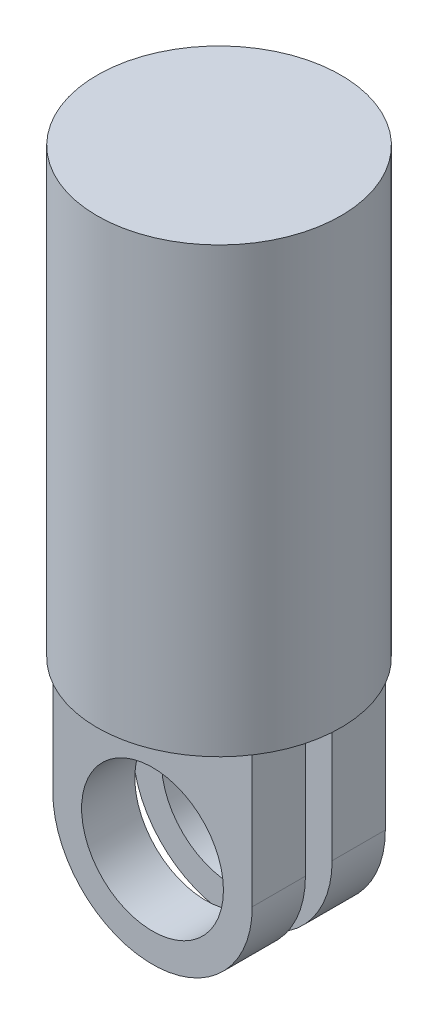
ISO-10303-21;
HEADER;
FILE_DESCRIPTION(('STEP AP214'),'2;1');
FILE_NAME('part.step','',(''),(''),'','','');
FILE_SCHEMA(('AUTOMOTIVE_DESIGN { 1 0 10303 214 1 1 1 1 }'));
ENDSEC;
DATA;
#1=APPLICATION_CONTEXT('core data for automotive mechanical design processes');
#2=APPLICATION_PROTOCOL_DEFINITION('international standard','automotive_design',2000,#1);
#3=PRODUCT_CONTEXT('',#1,'mechanical');
#4=PRODUCT('Part','Part','',(#3));
#5=PRODUCT_RELATED_PRODUCT_CATEGORY('part','',(#4));
#6=PRODUCT_DEFINITION_FORMATION('','',#4);
#7=PRODUCT_DEFINITION_CONTEXT('part definition',#1,'design');
#8=PRODUCT_DEFINITION('design','',#6,#7);
#9=PRODUCT_DEFINITION_SHAPE('','',#8);
#10=(LENGTH_UNIT() NAMED_UNIT(*) SI_UNIT(.MILLI.,.METRE.));
#11=(NAMED_UNIT(*) PLANE_ANGLE_UNIT() SI_UNIT($,.RADIAN.));
#12=(NAMED_UNIT(*) SI_UNIT($,.STERADIAN.) SOLID_ANGLE_UNIT());
#13=UNCERTAINTY_MEASURE_WITH_UNIT(LENGTH_MEASURE(1.E-05),#10,'distance_accuracy_value','');
#14=(GEOMETRIC_REPRESENTATION_CONTEXT(3) GLOBAL_UNCERTAINTY_ASSIGNED_CONTEXT((#13)) GLOBAL_UNIT_ASSIGNED_CONTEXT((#10,
#11,#12)) REPRESENTATION_CONTEXT('',''));
#15=CARTESIAN_POINT('',(0.,0.,0.));
#16=DIRECTION('',(0.,0.,1.));
#17=DIRECTION('',(1.,0.,0.));
#18=AXIS2_PLACEMENT_3D('',#15,#16,#17);
#19=CARTESIAN_POINT('',(0.,100.,0.));
#20=DIRECTION('',(0.,-1.,0.));
#21=DIRECTION('',(0.,0.,-1.));
#22=AXIS2_PLACEMENT_3D('',#19,#20,#21);
#23=CYLINDRICAL_SURFACE('',#22,27.5);
#24=CARTESIAN_POINT('',(0.,100.,0.));
#25=DIRECTION('',(0.,1.,0.));
#26=DIRECTION('',(0.,0.,1.));
#27=AXIS2_PLACEMENT_3D('',#24,#25,#26);
#28=CIRCLE('',#27,27.5);
#29=CARTESIAN_POINT('',(0.,100.,27.5));
#30=VERTEX_POINT('',#29);
#31=EDGE_CURVE('E11',#30,#30,#28,.T.);
#32=ORIENTED_EDGE('',*,*,#31,.F.);
#33=EDGE_LOOP('',(#32));
#34=FACE_BOUND('',#33,.T.);
#35=CARTESIAN_POINT('',(0.,0.,0.));
#36=DIRECTION('',(0.,1.,0.));
#37=DIRECTION('',(0.,0.,1.));
#38=AXIS2_PLACEMENT_3D('',#35,#36,#37);
#39=CIRCLE('',#38,27.5);
#40=CARTESIAN_POINT('',(0.,0.,27.5));
#41=VERTEX_POINT('',#40);
#42=EDGE_CURVE('E39',#41,#41,#39,.T.);
#43=ORIENTED_EDGE('',*,*,#42,.T.);
#44=EDGE_LOOP('',(#43));
#45=FACE_BOUND('',#44,.T.);
#46=ADVANCED_FACE('F36',(#34,#45),#23,.T.);
#47=CARTESIAN_POINT('',(0.,100.,0.));
#48=DIRECTION('',(0.,1.,0.));
#49=DIRECTION('',(0.,0.,1.));
#50=AXIS2_PLACEMENT_3D('',#47,#48,#49);
#51=PLANE('',#50);
#52=ORIENTED_EDGE('',*,*,#31,.T.);
#53=EDGE_LOOP('',(#52));
#54=FACE_BOUND('',#53,.T.);
#55=ADVANCED_FACE('F188',(#54),#51,.T.);
#56=CARTESIAN_POINT('',(0.,0.,0.));
#57=DIRECTION('',(0.,1.,0.));
#58=DIRECTION('',(0.,0.,1.));
#59=AXIS2_PLACEMENT_3D('',#56,#57,#58);
#60=PLANE('',#59);
#61=DIRECTION('',(0.,0.,1.));
#62=VECTOR('',#61,1.);
#63=CARTESIAN_POINT('',(22.5,0.,-15.010953));
#64=LINE('',#63,#62);
#65=CARTESIAN_POINT('',(22.5,0.,-15.010953));
#66=VERTEX_POINT('',#65);
#67=CARTESIAN_POINT('',(22.5000017429749,0.,-3.01095300000001));
#68=VERTEX_POINT('',#67);
#69=EDGE_CURVE('E50',#66,#68,#64,.T.);
#70=ORIENTED_EDGE('',*,*,#69,.F.);
#71=DIRECTION('',(-1.,0.,0.));
#72=VECTOR('',#71,1.);
#73=CARTESIAN_POINT('',(22.5,0.,-15.010953));
#74=LINE('',#73,#72);
#75=CARTESIAN_POINT('',(-22.5,0.,-15.010953));
#76=VERTEX_POINT('',#75);
#77=EDGE_CURVE('E55',#66,#76,#74,.T.);
#78=ORIENTED_EDGE('',*,*,#77,.T.);
#79=DIRECTION('',(0.,0.,1.));
#80=VECTOR('',#79,1.);
#81=CARTESIAN_POINT('',(-22.5,0.,-15.010953));
#82=LINE('',#81,#80);
#83=CARTESIAN_POINT('',(-22.5,0.,-3.01095300000001));
#84=VERTEX_POINT('',#83);
#85=EDGE_CURVE('E141',#76,#84,#82,.T.);
#86=ORIENTED_EDGE('',*,*,#85,.T.);
#87=DIRECTION('',(-1.,0.,0.));
#88=VECTOR('',#87,1.);
#89=CARTESIAN_POINT('',(22.5,0.,-3.01095300000001));
#90=LINE('',#89,#88);
#91=EDGE_CURVE('E128',#68,#84,#90,.T.);
#92=ORIENTED_EDGE('',*,*,#91,.F.);
#93=EDGE_LOOP('',(#70,#78,#86,#92));
#94=FACE_BOUND('',#93,.T.);
#95=DIRECTION('',(0.,0.,-1.));
#96=VECTOR('',#95,1.);
#97=CARTESIAN_POINT('',(-22.5,0.,15.010953));
#98=LINE('',#97,#96);
#99=CARTESIAN_POINT('',(-22.5,0.,15.010953));
#100=VERTEX_POINT('',#99);
#101=CARTESIAN_POINT('',(-22.5000017429749,0.,3.01095300000001));
#102=VERTEX_POINT('',#101);
#103=EDGE_CURVE('E174',#100,#102,#98,.T.);
#104=ORIENTED_EDGE('',*,*,#103,.F.);
#105=DIRECTION('',(-1.,0.,0.));
#106=VECTOR('',#105,1.);
#107=CARTESIAN_POINT('',(22.5,0.,15.010953));
#108=LINE('',#107,#106);
#109=CARTESIAN_POINT('',(22.5,0.,15.010953));
#110=VERTEX_POINT('',#109);
#111=EDGE_CURVE('E163',#110,#100,#108,.T.);
#112=ORIENTED_EDGE('',*,*,#111,.F.);
#113=DIRECTION('',(0.,0.,-1.));
#114=VECTOR('',#113,1.);
#115=CARTESIAN_POINT('',(22.5,0.,15.010953));
#116=LINE('',#115,#114);
#117=CARTESIAN_POINT('',(22.5,0.,3.01095300000001));
#118=VERTEX_POINT('',#117);
#119=EDGE_CURVE('E177',#110,#118,#116,.T.);
#120=ORIENTED_EDGE('',*,*,#119,.T.);
#121=DIRECTION('',(-1.,0.,0.));
#122=VECTOR('',#121,1.);
#123=CARTESIAN_POINT('',(22.5,0.,3.01095300000001));
#124=LINE('',#123,#122);
#125=EDGE_CURVE('E149',#118,#102,#124,.T.);
#126=ORIENTED_EDGE('',*,*,#125,.T.);
#127=EDGE_LOOP('',(#104,#112,#120,#126));
#128=FACE_BOUND('',#127,.T.);
#129=ORIENTED_EDGE('',*,*,#42,.F.);
#130=EDGE_LOOP('',(#129));
#131=FACE_BOUND('',#130,.T.);
#132=ADVANCED_FACE('F185',(#94,#128,#131),#60,.F.);
#133=CARTESIAN_POINT('',(0.,-30.00885629,15.010953));
#134=DIRECTION('',(0.,0.,1.));
#135=DIRECTION('',(1.,0.,0.));
#136=AXIS2_PLACEMENT_3D('',#133,#134,#135);
#137=PLANE('',#136);
#138=DIRECTION('',(0.,1.,0.));
#139=VECTOR('',#138,1.);
#140=CARTESIAN_POINT('',(22.5,0.,15.010953));
#141=LINE('',#140,#139);
#142=CARTESIAN_POINT('',(22.5,-30.,15.010953));
#143=VERTEX_POINT('',#142);
#144=EDGE_CURVE('E160',#143,#110,#141,.T.);
#145=ORIENTED_EDGE('',*,*,#144,.T.);
#146=ORIENTED_EDGE('',*,*,#111,.T.);
#147=DIRECTION('',(0.,-1.,0.));
#148=VECTOR('',#147,1.);
#149=CARTESIAN_POINT('',(-22.5,0.,15.010953));
#150=LINE('',#149,#148);
#151=CARTESIAN_POINT('',(-22.5,-30.,15.010953));
#152=VERTEX_POINT('',#151);
#153=EDGE_CURVE('E166',#100,#152,#150,.T.);
#154=ORIENTED_EDGE('',*,*,#153,.T.);
#155=CARTESIAN_POINT('',(0.,-30.00885629,15.010953));
#156=DIRECTION('',(0.,0.,1.));
#157=DIRECTION('',(1.,0.,0.));
#158=AXIS2_PLACEMENT_3D('',#155,#156,#157);
#159=CIRCLE('',#158,22.5000017429749);
#160=EDGE_CURVE('E168',#152,#143,#159,.T.);
#161=ORIENTED_EDGE('',*,*,#160,.T.);
#162=EDGE_LOOP('',(#145,#146,#154,#161));
#163=FACE_BOUND('',#162,.T.);
#164=CARTESIAN_POINT('',(0.,-30.00885629,15.010953));
#165=DIRECTION('',(0.,0.,1.));
#166=DIRECTION('',(1.,0.,0.));
#167=AXIS2_PLACEMENT_3D('',#164,#165,#166);
#168=CIRCLE('',#167,16.);
#169=CARTESIAN_POINT('',(16.,-30.00885629,15.010953));
#170=VERTEX_POINT('',#169);
#171=EDGE_CURVE('E157',#170,#170,#168,.T.);
#172=ORIENTED_EDGE('',*,*,#171,.F.);
#173=EDGE_LOOP('',(#172));
#174=FACE_BOUND('',#173,.T.);
#175=ADVANCED_FACE('F187',(#163,#174),#137,.T.);
#176=CARTESIAN_POINT('',(22.5,0.,15.010953));
#177=DIRECTION('',(-1.,0.,0.));
#178=DIRECTION('',(0.,0.,1.));
#179=AXIS2_PLACEMENT_3D('',#176,#177,#178);
#180=PLANE('',#179);
#181=DIRECTION('',(0.,0.,-1.));
#182=VECTOR('',#181,1.);
#183=CARTESIAN_POINT('',(22.5,-30.,15.010953));
#184=LINE('',#183,#182);
#185=CARTESIAN_POINT('',(22.5,-30.,3.01095300000001));
#186=VERTEX_POINT('',#185);
#187=EDGE_CURVE('E170',#143,#186,#184,.T.);
#188=ORIENTED_EDGE('',*,*,#187,.T.);
#189=DIRECTION('',(0.,1.,0.));
#190=VECTOR('',#189,1.);
#191=CARTESIAN_POINT('',(22.5,0.,3.01095300000001));
#192=LINE('',#191,#190);
#193=EDGE_CURVE('E146',#186,#118,#192,.T.);
#194=ORIENTED_EDGE('',*,*,#193,.T.);
#195=ORIENTED_EDGE('',*,*,#119,.F.);
#196=ORIENTED_EDGE('',*,*,#144,.F.);
#197=EDGE_LOOP('',(#188,#194,#195,#196));
#198=FACE_BOUND('',#197,.T.);
#199=ADVANCED_FACE('F193',(#198),#180,.F.);
#200=CARTESIAN_POINT('',(-22.5,0.,15.010953));
#201=DIRECTION('',(1.,0.,0.));
#202=DIRECTION('',(0.,0.,-1.));
#203=AXIS2_PLACEMENT_3D('',#200,#201,#202);
#204=PLANE('',#203);
#205=ORIENTED_EDGE('',*,*,#103,.T.);
#206=DIRECTION('',(0.,-1.,0.));
#207=VECTOR('',#206,1.);
#208=CARTESIAN_POINT('',(-22.5,0.,3.01095300000001));
#209=LINE('',#208,#207);
#210=CARTESIAN_POINT('',(-22.5,-30.,3.01095300000001));
#211=VERTEX_POINT('',#210);
#212=EDGE_CURVE('E151',#102,#211,#209,.T.);
#213=ORIENTED_EDGE('',*,*,#212,.T.);
#214=DIRECTION('',(0.,0.,-1.));
#215=VECTOR('',#214,1.);
#216=CARTESIAN_POINT('',(-22.5,-30.,15.010953));
#217=LINE('',#216,#215);
#218=EDGE_CURVE('E172',#152,#211,#217,.T.);
#219=ORIENTED_EDGE('',*,*,#218,.F.);
#220=ORIENTED_EDGE('',*,*,#153,.F.);
#221=EDGE_LOOP('',(#205,#213,#219,#220));
#222=FACE_BOUND('',#221,.T.);
#223=ADVANCED_FACE('F223',(#222),#204,.F.);
#224=CARTESIAN_POINT('',(0.,-30.00885629,15.010953));
#225=DIRECTION('',(0.,0.,-1.));
#226=DIRECTION('',(-1.,0.,0.));
#227=AXIS2_PLACEMENT_3D('',#224,#225,#226);
#228=CYLINDRICAL_SURFACE('',#227,22.5000017429749);
#229=ORIENTED_EDGE('',*,*,#218,.T.);
#230=CARTESIAN_POINT('',(0.,-30.00885629,3.01095300000001));
#231=DIRECTION('',(0.,0.,1.));
#232=DIRECTION('',(1.,0.,0.));
#233=AXIS2_PLACEMENT_3D('',#230,#231,#232);
#234=CIRCLE('',#233,22.5000017429749);
#235=EDGE_CURVE('E154',#211,#186,#234,.T.);
#236=ORIENTED_EDGE('',*,*,#235,.T.);
#237=ORIENTED_EDGE('',*,*,#187,.F.);
#238=ORIENTED_EDGE('',*,*,#160,.F.);
#239=EDGE_LOOP('',(#229,#236,#237,#238));
#240=FACE_BOUND('',#239,.T.);
#241=ADVANCED_FACE('F233',(#240),#228,.T.);
#242=CARTESIAN_POINT('',(0.,-30.00885629,15.010953));
#243=DIRECTION('',(0.,0.,-1.));
#244=DIRECTION('',(-1.,0.,0.));
#245=AXIS2_PLACEMENT_3D('',#242,#243,#244);
#246=CYLINDRICAL_SURFACE('',#245,16.);
#247=ORIENTED_EDGE('',*,*,#171,.T.);
#248=EDGE_LOOP('',(#247));
#249=FACE_BOUND('',#248,.T.);
#250=CARTESIAN_POINT('',(0.,-30.00885629,3.01095300000001));
#251=DIRECTION('',(0.,0.,1.));
#252=DIRECTION('',(1.,0.,0.));
#253=AXIS2_PLACEMENT_3D('',#250,#251,#252);
#254=CIRCLE('',#253,16.);
#255=CARTESIAN_POINT('',(16.,-30.00885629,3.01095300000001));
#256=VERTEX_POINT('',#255);
#257=EDGE_CURVE('E108',#256,#256,#254,.T.);
#258=ORIENTED_EDGE('',*,*,#257,.F.);
#259=EDGE_LOOP('',(#258));
#260=FACE_BOUND('',#259,.T.);
#261=ADVANCED_FACE('F243',(#249,#260),#246,.F.);
#262=CARTESIAN_POINT('',(0.,-30.00885629,3.01095300000001));
#263=DIRECTION('',(0.,0.,1.));
#264=DIRECTION('',(1.,0.,0.));
#265=AXIS2_PLACEMENT_3D('',#262,#263,#264);
#266=PLANE('',#265);
#267=ORIENTED_EDGE('',*,*,#257,.T.);
#268=EDGE_LOOP('',(#267));
#269=FACE_BOUND('',#268,.T.);
#270=ORIENTED_EDGE('',*,*,#193,.F.);
#271=ORIENTED_EDGE('',*,*,#235,.F.);
#272=ORIENTED_EDGE('',*,*,#212,.F.);
#273=ORIENTED_EDGE('',*,*,#125,.F.);
#274=EDGE_LOOP('',(#270,#271,#272,#273));
#275=FACE_BOUND('',#274,.T.);
#276=ADVANCED_FACE('F253',(#269,#275),#266,.F.);
#277=CARTESIAN_POINT('',(22.5,0.,-15.010953));
#278=DIRECTION('',(1.,0.,0.));
#279=DIRECTION('',(0.,0.,-1.));
#280=AXIS2_PLACEMENT_3D('',#277,#278,#279);
#281=PLANE('',#280);
#282=ORIENTED_EDGE('',*,*,#69,.T.);
#283=DIRECTION('',(0.,1.,0.));
#284=VECTOR('',#283,1.);
#285=CARTESIAN_POINT('',(22.5,0.,-3.01095300000001));
#286=LINE('',#285,#284);
#287=CARTESIAN_POINT('',(22.5,-30.,-3.01095300000001));
#288=VERTEX_POINT('',#287);
#289=EDGE_CURVE('E117',#288,#68,#286,.T.);
#290=ORIENTED_EDGE('',*,*,#289,.F.);
#291=DIRECTION('',(0.,0.,1.));
#292=VECTOR('',#291,1.);
#293=CARTESIAN_POINT('',(22.5,-30.,-15.010953));
#294=LINE('',#293,#292);
#295=CARTESIAN_POINT('',(22.5,-30.,-15.010953));
#296=VERTEX_POINT('',#295);
#297=EDGE_CURVE('E99',#296,#288,#294,.T.);
#298=ORIENTED_EDGE('',*,*,#297,.F.);
#299=DIRECTION('',(0.,1.,0.));
#300=VECTOR('',#299,1.);
#301=CARTESIAN_POINT('',(22.5,0.,-15.010953));
#302=LINE('',#301,#300);
#303=EDGE_CURVE('E133',#296,#66,#302,.T.);
#304=ORIENTED_EDGE('',*,*,#303,.T.);
#305=EDGE_LOOP('',(#282,#290,#298,#304));
#306=FACE_BOUND('',#305,.T.);
#307=ADVANCED_FACE('F121',(#306),#281,.T.);
#308=CARTESIAN_POINT('',(0.,-30.00885629,-15.010953));
#309=DIRECTION('',(0.,0.,1.));
#310=DIRECTION('',(1.,0.,0.));
#311=AXIS2_PLACEMENT_3D('',#308,#309,#310);
#312=CYLINDRICAL_SURFACE('',#311,22.5000017429749);
#313=ORIENTED_EDGE('',*,*,#297,.T.);
#314=CARTESIAN_POINT('',(0.,-30.00885629,-3.01095300000001));
#315=DIRECTION('',(0.,0.,1.));
#316=DIRECTION('',(1.,0.,0.));
#317=AXIS2_PLACEMENT_3D('',#314,#315,#316);
#318=CIRCLE('',#317,22.5000017429749);
#319=CARTESIAN_POINT('',(-22.5,-30.,-3.01095300000001));
#320=VERTEX_POINT('',#319);
#321=EDGE_CURVE('E102',#320,#288,#318,.T.);
#322=ORIENTED_EDGE('',*,*,#321,.F.);
#323=DIRECTION('',(0.,0.,1.));
#324=VECTOR('',#323,1.);
#325=CARTESIAN_POINT('',(-22.5,-30.,-15.010953));
#326=LINE('',#325,#324);
#327=CARTESIAN_POINT('',(-22.5,-30.,-15.010953));
#328=VERTEX_POINT('',#327);
#329=EDGE_CURVE('E109',#328,#320,#326,.T.);
#330=ORIENTED_EDGE('',*,*,#329,.F.);
#331=CARTESIAN_POINT('',(0.,-30.00885629,-15.010953));
#332=DIRECTION('',(0.,0.,1.));
#333=DIRECTION('',(1.,0.,0.));
#334=AXIS2_PLACEMENT_3D('',#331,#332,#333);
#335=CIRCLE('',#334,22.5000017429749);
#336=EDGE_CURVE('E104',#328,#296,#335,.T.);
#337=ORIENTED_EDGE('',*,*,#336,.T.);
#338=EDGE_LOOP('',(#313,#322,#330,#337));
#339=FACE_BOUND('',#338,.T.);
#340=ADVANCED_FACE('F101',(#339),#312,.T.);
#341=CARTESIAN_POINT('',(-22.5,0.,-15.010953));
#342=DIRECTION('',(-1.,0.,0.));
#343=DIRECTION('',(0.,0.,1.));
#344=AXIS2_PLACEMENT_3D('',#341,#342,#343);
#345=PLANE('',#344);
#346=ORIENTED_EDGE('',*,*,#329,.T.);
#347=DIRECTION('',(0.,-1.,0.));
#348=VECTOR('',#347,1.);
#349=CARTESIAN_POINT('',(-22.5,0.,-3.01095300000001));
#350=LINE('',#349,#348);
#351=EDGE_CURVE('E119',#84,#320,#350,.T.);
#352=ORIENTED_EDGE('',*,*,#351,.F.);
#353=ORIENTED_EDGE('',*,*,#85,.F.);
#354=DIRECTION('',(0.,-1.,0.));
#355=VECTOR('',#354,1.);
#356=CARTESIAN_POINT('',(-22.5,0.,-15.010953));
#357=LINE('',#356,#355);
#358=EDGE_CURVE('E136',#76,#328,#357,.T.);
#359=ORIENTED_EDGE('',*,*,#358,.T.);
#360=EDGE_LOOP('',(#346,#352,#353,#359));
#361=FACE_BOUND('',#360,.T.);
#362=ADVANCED_FACE('F283',(#361),#345,.T.);
#363=CARTESIAN_POINT('',(0.,-30.00885629,-15.010953));
#364=DIRECTION('',(0.,0.,-1.));
#365=DIRECTION('',(1.,0.,0.));
#366=AXIS2_PLACEMENT_3D('',#363,#364,#365);
#367=PLANE('',#366);
#368=CARTESIAN_POINT('',(0.,-30.00885629,-15.010953));
#369=DIRECTION('',(0.,0.,1.));
#370=DIRECTION('',(1.,0.,0.));
#371=AXIS2_PLACEMENT_3D('',#368,#369,#370);
#372=CIRCLE('',#371,16.);
#373=CARTESIAN_POINT('',(16.,-30.00885629,-15.010953));
#374=VERTEX_POINT('',#373);
#375=EDGE_CURVE('E130',#374,#374,#372,.T.);
#376=ORIENTED_EDGE('',*,*,#375,.T.);
#377=EDGE_LOOP('',(#376));
#378=FACE_BOUND('',#377,.T.);
#379=ORIENTED_EDGE('',*,*,#303,.F.);
#380=ORIENTED_EDGE('',*,*,#336,.F.);
#381=ORIENTED_EDGE('',*,*,#358,.F.);
#382=ORIENTED_EDGE('',*,*,#77,.F.);
#383=EDGE_LOOP('',(#379,#380,#381,#382));
#384=FACE_BOUND('',#383,.T.);
#385=ADVANCED_FACE('F292',(#378,#384),#367,.T.);
#386=CARTESIAN_POINT('',(0.,-30.00885629,-15.010953));
#387=DIRECTION('',(0.,0.,1.));
#388=DIRECTION('',(1.,0.,0.));
#389=AXIS2_PLACEMENT_3D('',#386,#387,#388);
#390=CYLINDRICAL_SURFACE('',#389,16.);
#391=ORIENTED_EDGE('',*,*,#375,.F.);
#392=EDGE_LOOP('',(#391));
#393=FACE_BOUND('',#392,.T.);
#394=CARTESIAN_POINT('',(0.,-30.00885629,-3.01095300000001));
#395=DIRECTION('',(0.,0.,1.));
#396=DIRECTION('',(1.,0.,0.));
#397=AXIS2_PLACEMENT_3D('',#394,#395,#396);
#398=CIRCLE('',#397,16.);
#399=CARTESIAN_POINT('',(16.,-30.00885629,-3.01095300000001));
#400=VERTEX_POINT('',#399);
#401=EDGE_CURVE('E122',#400,#400,#398,.T.);
#402=ORIENTED_EDGE('',*,*,#401,.T.);
#403=EDGE_LOOP('',(#402));
#404=FACE_BOUND('',#403,.T.);
#405=ADVANCED_FACE('F302',(#393,#404),#390,.F.);
#406=CARTESIAN_POINT('',(0.,-30.00885629,-3.01095300000001));
#407=DIRECTION('',(0.,0.,-1.));
#408=DIRECTION('',(1.,0.,0.));
#409=AXIS2_PLACEMENT_3D('',#406,#407,#408);
#410=PLANE('',#409);
#411=ORIENTED_EDGE('',*,*,#289,.T.);
#412=ORIENTED_EDGE('',*,*,#91,.T.);
#413=ORIENTED_EDGE('',*,*,#351,.T.);
#414=ORIENTED_EDGE('',*,*,#321,.T.);
#415=EDGE_LOOP('',(#411,#412,#413,#414));
#416=FACE_BOUND('',#415,.T.);
#417=ORIENTED_EDGE('',*,*,#401,.F.);
#418=EDGE_LOOP('',(#417));
#419=FACE_BOUND('',#418,.T.);
#420=ADVANCED_FACE('F114',(#416,#419),#410,.F.);
#421=CLOSED_SHELL('',(#46,#55,#132,#175,#199,#223,#241,#261,#276,#307,#340,#362,#385,#405,#420));
#422=MANIFOLD_SOLID_BREP('B2',#421);
#423=ADVANCED_BREP_SHAPE_REPRESENTATION('',(#18,#422),#14);
#424=SHAPE_DEFINITION_REPRESENTATION(#9,#423);
ENDSEC;
END-ISO-10303-21;
